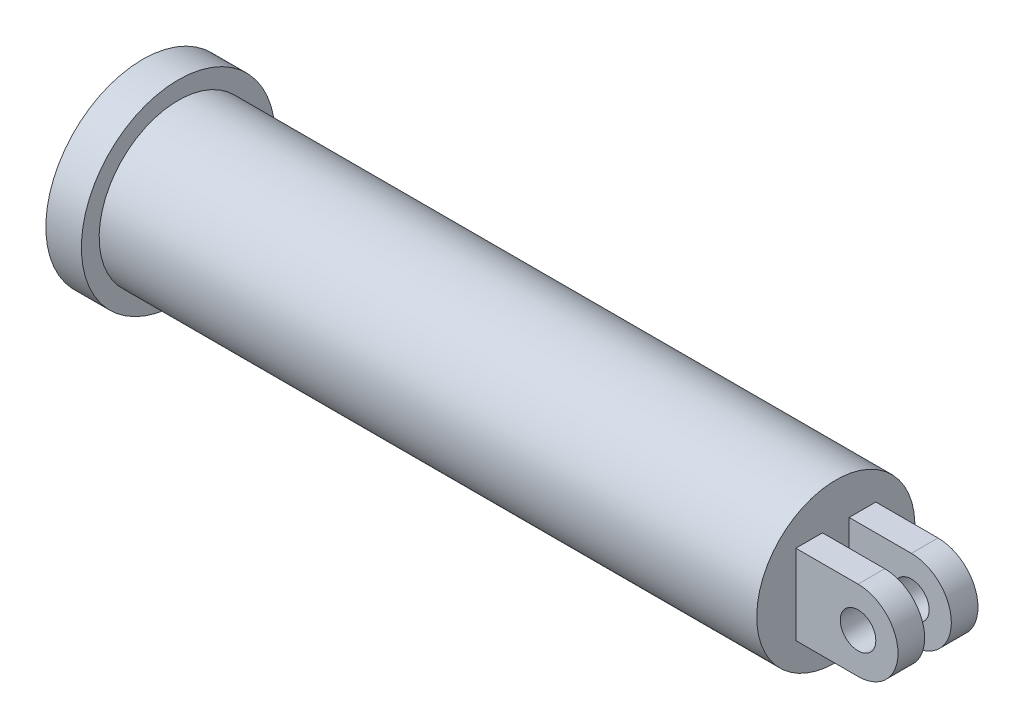
ISO-10303-21;
HEADER;
FILE_DESCRIPTION(('STEP AP214'),'2;1');
FILE_NAME('part.step','',(''),(''),'','','');
FILE_SCHEMA(('AUTOMOTIVE_DESIGN { 1 0 10303 214 1 1 1 1 }'));
ENDSEC;
DATA;
#1=APPLICATION_CONTEXT('core data for automotive mechanical design processes');
#2=APPLICATION_PROTOCOL_DEFINITION('international standard','automotive_design',2000,#1);
#3=PRODUCT_CONTEXT('',#1,'mechanical');
#4=PRODUCT('Part','Part','',(#3));
#5=PRODUCT_RELATED_PRODUCT_CATEGORY('part','',(#4));
#6=PRODUCT_DEFINITION_FORMATION('','',#4);
#7=PRODUCT_DEFINITION_CONTEXT('part definition',#1,'design');
#8=PRODUCT_DEFINITION('design','',#6,#7);
#9=PRODUCT_DEFINITION_SHAPE('','',#8);
#10=(LENGTH_UNIT() NAMED_UNIT(*) SI_UNIT(.MILLI.,.METRE.));
#11=(NAMED_UNIT(*) PLANE_ANGLE_UNIT() SI_UNIT($,.RADIAN.));
#12=(NAMED_UNIT(*) SI_UNIT($,.STERADIAN.) SOLID_ANGLE_UNIT());
#13=UNCERTAINTY_MEASURE_WITH_UNIT(LENGTH_MEASURE(1.E-05),#10,'distance_accuracy_value','');
#14=(GEOMETRIC_REPRESENTATION_CONTEXT(3) GLOBAL_UNCERTAINTY_ASSIGNED_CONTEXT((#13)) GLOBAL_UNIT_ASSIGNED_CONTEXT((#10,
#11,#12)) REPRESENTATION_CONTEXT('',''));
#15=CARTESIAN_POINT('',(0.,0.,0.));
#16=DIRECTION('',(0.,0.,1.));
#17=DIRECTION('',(1.,0.,0.));
#18=AXIS2_PLACEMENT_3D('',#15,#16,#17);
#19=CARTESIAN_POINT('',(195.,0.,0.));
#20=DIRECTION('',(-1.,0.,0.));
#21=DIRECTION('',(0.,-1.,0.));
#22=AXIS2_PLACEMENT_3D('',#19,#20,#21);
#23=PLANE('',#22);
#24=DIRECTION('',(0.,0.,-1.));
#25=VECTOR('',#24,1.);
#26=CARTESIAN_POINT('',(195.,-22.5,22.5));
#27=LINE('',#26,#25);
#28=CARTESIAN_POINT('',(195.,-22.5,22.5));
#29=VERTEX_POINT('',#28);
#30=CARTESIAN_POINT('',(195.,-22.5,7.5));
#31=VERTEX_POINT('',#30);
#32=EDGE_CURVE('E71',#29,#31,#27,.T.);
#33=ORIENTED_EDGE('',*,*,#32,.F.);
#34=DIRECTION('',(0.,-1.,0.));
#35=VECTOR('',#34,1.);
#36=CARTESIAN_POINT('',(195.,22.5,22.5));
#37=LINE('',#36,#35);
#38=CARTESIAN_POINT('',(195.,22.5,22.5));
#39=VERTEX_POINT('',#38);
#40=EDGE_CURVE('E148',#39,#29,#37,.T.);
#41=ORIENTED_EDGE('',*,*,#40,.F.);
#42=DIRECTION('',(0.,0.,-1.));
#43=VECTOR('',#42,1.);
#44=CARTESIAN_POINT('',(195.,22.5,22.5));
#45=LINE('',#44,#43);
#46=CARTESIAN_POINT('',(195.,22.5,7.5));
#47=VERTEX_POINT('',#46);
#48=EDGE_CURVE('E159',#39,#47,#45,.T.);
#49=ORIENTED_EDGE('',*,*,#48,.T.);
#50=DIRECTION('',(0.,-1.,0.));
#51=VECTOR('',#50,1.);
#52=CARTESIAN_POINT('',(195.,22.5,7.5));
#53=LINE('',#52,#51);
#54=EDGE_CURVE('E146',#47,#31,#53,.T.);
#55=ORIENTED_EDGE('',*,*,#54,.T.);
#56=EDGE_LOOP('',(#33,#41,#49,#55));
#57=FACE_BOUND('',#56,.T.);
#58=CARTESIAN_POINT('',(195.,0.,0.));
#59=DIRECTION('',(-1.,0.,0.));
#60=DIRECTION('',(0.,-1.,0.));
#61=AXIS2_PLACEMENT_3D('',#58,#59,#60);
#62=CIRCLE('',#61,44.4999999999999);
#63=CARTESIAN_POINT('',(195.,-44.4999999999999,0.));
#64=VERTEX_POINT('',#63);
#65=EDGE_CURVE('E13',#64,#64,#62,.T.);
#66=ORIENTED_EDGE('',*,*,#65,.F.);
#67=EDGE_LOOP('',(#66));
#68=FACE_BOUND('',#67,.T.);
#69=DIRECTION('',(0.,-1.,0.));
#70=VECTOR('',#69,1.);
#71=CARTESIAN_POINT('',(195.,22.5,-22.5));
#72=LINE('',#71,#70);
#73=CARTESIAN_POINT('',(195.,22.5,-22.5));
#74=VERTEX_POINT('',#73);
#75=CARTESIAN_POINT('',(195.,-22.5,-22.5));
#76=VERTEX_POINT('',#75);
#77=EDGE_CURVE('E115',#74,#76,#72,.T.);
#78=ORIENTED_EDGE('',*,*,#77,.T.);
#79=DIRECTION('',(0.,0.,1.));
#80=VECTOR('',#79,1.);
#81=CARTESIAN_POINT('',(195.,-22.5,-22.5));
#82=LINE('',#81,#80);
#83=CARTESIAN_POINT('',(195.,-22.5,-7.5));
#84=VERTEX_POINT('',#83);
#85=EDGE_CURVE('E262',#76,#84,#82,.T.);
#86=ORIENTED_EDGE('',*,*,#85,.T.);
#87=DIRECTION('',(0.,-1.,0.));
#88=VECTOR('',#87,1.);
#89=CARTESIAN_POINT('',(195.,22.5,-7.5));
#90=LINE('',#89,#88);
#91=CARTESIAN_POINT('',(195.,22.5,-7.5));
#92=VERTEX_POINT('',#91);
#93=EDGE_CURVE('E135',#92,#84,#90,.T.);
#94=ORIENTED_EDGE('',*,*,#93,.F.);
#95=DIRECTION('',(0.,0.,1.));
#96=VECTOR('',#95,1.);
#97=CARTESIAN_POINT('',(195.,22.5,-22.5));
#98=LINE('',#97,#96);
#99=EDGE_CURVE('E130',#74,#92,#98,.T.);
#100=ORIENTED_EDGE('',*,*,#99,.F.);
#101=EDGE_LOOP('',(#78,#86,#94,#100));
#102=FACE_BOUND('',#101,.T.);
#103=ADVANCED_FACE('F48',(#57,#68,#102),#23,.F.);
#104=CARTESIAN_POINT('',(-195.,54.5,0.));
#105=DIRECTION('',(1.,0.,0.));
#106=DIRECTION('',(0.,1.,0.));
#107=AXIS2_PLACEMENT_3D('',#104,#105,#106);
#108=PLANE('',#107);
#109=CARTESIAN_POINT('',(-195.,0.,0.));
#110=DIRECTION('',(-1.,0.,0.));
#111=DIRECTION('',(0.,-1.,0.));
#112=AXIS2_PLACEMENT_3D('',#109,#110,#111);
#113=CIRCLE('',#112,54.5);
#114=CARTESIAN_POINT('',(-195.,-54.5,0.));
#115=VERTEX_POINT('',#114);
#116=EDGE_CURVE('E175',#115,#115,#113,.T.);
#117=ORIENTED_EDGE('',*,*,#116,.T.);
#118=EDGE_LOOP('',(#117));
#119=FACE_BOUND('',#118,.T.);
#120=ADVANCED_FACE('F50',(#119),#108,.F.);
#121=CARTESIAN_POINT('',(-195.,0.,0.));
#122=DIRECTION('',(-1.,0.,0.));
#123=DIRECTION('',(0.,-1.,0.));
#124=AXIS2_PLACEMENT_3D('',#121,#122,#123);
#125=CYLINDRICAL_SURFACE('',#124,44.4999999999999);
#126=CARTESIAN_POINT('',(-175.,0.,0.));
#127=DIRECTION('',(-1.,0.,0.));
#128=DIRECTION('',(0.,-1.,0.));
#129=AXIS2_PLACEMENT_3D('',#126,#127,#128);
#130=CIRCLE('',#129,44.5);
#131=CARTESIAN_POINT('',(-175.,-44.4999999999999,0.));
#132=VERTEX_POINT('',#131);
#133=EDGE_CURVE('E56',#132,#132,#130,.T.);
#134=ORIENTED_EDGE('',*,*,#133,.F.);
#135=EDGE_LOOP('',(#134));
#136=FACE_BOUND('',#135,.T.);
#137=ORIENTED_EDGE('',*,*,#65,.T.);
#138=EDGE_LOOP('',(#137));
#139=FACE_BOUND('',#138,.T.);
#140=ADVANCED_FACE('F185',(#136,#139),#125,.T.);
#141=CARTESIAN_POINT('',(-175.,44.5,0.));
#142=DIRECTION('',(-1.,0.,0.));
#143=DIRECTION('',(0.,-1.,0.));
#144=AXIS2_PLACEMENT_3D('',#141,#142,#143);
#145=PLANE('',#144);
#146=CARTESIAN_POINT('',(-175.,0.,0.));
#147=DIRECTION('',(-1.,0.,0.));
#148=DIRECTION('',(0.,-1.,0.));
#149=AXIS2_PLACEMENT_3D('',#146,#147,#148);
#150=CIRCLE('',#149,54.5);
#151=CARTESIAN_POINT('',(-175.,-54.5,0.));
#152=VERTEX_POINT('',#151);
#153=EDGE_CURVE('E178',#152,#152,#150,.T.);
#154=ORIENTED_EDGE('',*,*,#153,.F.);
#155=EDGE_LOOP('',(#154));
#156=FACE_BOUND('',#155,.T.);
#157=ORIENTED_EDGE('',*,*,#133,.T.);
#158=EDGE_LOOP('',(#157));
#159=FACE_BOUND('',#158,.T.);
#160=ADVANCED_FACE('F183',(#156,#159),#145,.F.);
#161=CARTESIAN_POINT('',(-195.,0.,0.));
#162=DIRECTION('',(-1.,0.,0.));
#163=DIRECTION('',(0.,-1.,0.));
#164=AXIS2_PLACEMENT_3D('',#161,#162,#163);
#165=CYLINDRICAL_SURFACE('',#164,54.5);
#166=ORIENTED_EDGE('',*,*,#116,.F.);
#167=EDGE_LOOP('',(#166));
#168=FACE_BOUND('',#167,.T.);
#169=ORIENTED_EDGE('',*,*,#153,.T.);
#170=EDGE_LOOP('',(#169));
#171=FACE_BOUND('',#170,.T.);
#172=ADVANCED_FACE('F199',(#168,#171),#165,.T.);
#173=CARTESIAN_POINT('',(230.,0.,22.5));
#174=DIRECTION('',(0.,0.,-1.));
#175=DIRECTION('',(-1.,0.,0.));
#176=AXIS2_PLACEMENT_3D('',#173,#174,#175);
#177=PLANE('',#176);
#178=ORIENTED_EDGE('',*,*,#40,.T.);
#179=DIRECTION('',(1.,0.,0.));
#180=VECTOR('',#179,1.);
#181=CARTESIAN_POINT('',(195.,-22.5,22.5));
#182=LINE('',#181,#180);
#183=CARTESIAN_POINT('',(230.,-22.5,22.5));
#184=VERTEX_POINT('',#183);
#185=EDGE_CURVE('E151',#29,#184,#182,.T.);
#186=ORIENTED_EDGE('',*,*,#185,.T.);
#187=CARTESIAN_POINT('',(230.,0.,22.5));
#188=DIRECTION('',(0.,0.,1.));
#189=DIRECTION('',(-1.,0.,0.));
#190=AXIS2_PLACEMENT_3D('',#187,#188,#189);
#191=CIRCLE('',#190,22.5);
#192=CARTESIAN_POINT('',(230.,22.5,22.5));
#193=VERTEX_POINT('',#192);
#194=EDGE_CURVE('E154',#184,#193,#191,.T.);
#195=ORIENTED_EDGE('',*,*,#194,.T.);
#196=DIRECTION('',(-1.,0.,0.));
#197=VECTOR('',#196,1.);
#198=CARTESIAN_POINT('',(195.,22.5,22.5));
#199=LINE('',#198,#197);
#200=EDGE_CURVE('E156',#193,#39,#199,.T.);
#201=ORIENTED_EDGE('',*,*,#200,.T.);
#202=EDGE_LOOP('',(#178,#186,#195,#201));
#203=FACE_BOUND('',#202,.T.);
#204=CARTESIAN_POINT('',(230.,0.,22.5));
#205=DIRECTION('',(0.,0.,1.));
#206=DIRECTION('',(1.,0.,0.));
#207=AXIS2_PLACEMENT_3D('',#204,#205,#206);
#208=CIRCLE('',#207,10.);
#209=CARTESIAN_POINT('',(240.,0.,22.5));
#210=VERTEX_POINT('',#209);
#211=EDGE_CURVE('E139',#210,#210,#208,.T.);
#212=ORIENTED_EDGE('',*,*,#211,.F.);
#213=EDGE_LOOP('',(#212));
#214=FACE_BOUND('',#213,.T.);
#215=ADVANCED_FACE('F203',(#203,#214),#177,.F.);
#216=CARTESIAN_POINT('',(230.,0.,7.5));
#217=DIRECTION('',(0.,0.,-1.));
#218=DIRECTION('',(-1.,0.,0.));
#219=AXIS2_PLACEMENT_3D('',#216,#217,#218);
#220=PLANE('',#219);
#221=ORIENTED_EDGE('',*,*,#54,.F.);
#222=DIRECTION('',(-1.,0.,0.));
#223=VECTOR('',#222,1.);
#224=CARTESIAN_POINT('',(195.,22.5,7.5));
#225=LINE('',#224,#223);
#226=CARTESIAN_POINT('',(230.,22.5,7.5));
#227=VERTEX_POINT('',#226);
#228=EDGE_CURVE('E152',#227,#47,#225,.T.);
#229=ORIENTED_EDGE('',*,*,#228,.F.);
#230=CARTESIAN_POINT('',(230.,0.,7.5));
#231=DIRECTION('',(0.,0.,1.));
#232=DIRECTION('',(-1.,0.,0.));
#233=AXIS2_PLACEMENT_3D('',#230,#231,#232);
#234=CIRCLE('',#233,22.5);
#235=CARTESIAN_POINT('',(230.,-22.5,7.5));
#236=VERTEX_POINT('',#235);
#237=EDGE_CURVE('E163',#236,#227,#234,.T.);
#238=ORIENTED_EDGE('',*,*,#237,.F.);
#239=DIRECTION('',(1.,0.,0.));
#240=VECTOR('',#239,1.);
#241=CARTESIAN_POINT('',(195.,-22.5,7.5));
#242=LINE('',#241,#240);
#243=EDGE_CURVE('E161',#31,#236,#242,.T.);
#244=ORIENTED_EDGE('',*,*,#243,.F.);
#245=EDGE_LOOP('',(#221,#229,#238,#244));
#246=FACE_BOUND('',#245,.T.);
#247=CARTESIAN_POINT('',(230.,0.,7.5));
#248=DIRECTION('',(0.,0.,1.));
#249=DIRECTION('',(1.,0.,0.));
#250=AXIS2_PLACEMENT_3D('',#247,#248,#249);
#251=CIRCLE('',#250,10.);
#252=CARTESIAN_POINT('',(240.,0.,7.5));
#253=VERTEX_POINT('',#252);
#254=EDGE_CURVE('E136',#253,#253,#251,.T.);
#255=ORIENTED_EDGE('',*,*,#254,.T.);
#256=EDGE_LOOP('',(#255));
#257=FACE_BOUND('',#256,.T.);
#258=ADVANCED_FACE('F209',(#246,#257),#220,.T.);
#259=CARTESIAN_POINT('',(195.,-22.5,22.5));
#260=DIRECTION('',(0.,1.,0.));
#261=DIRECTION('',(-1.,0.,0.));
#262=AXIS2_PLACEMENT_3D('',#259,#260,#261);
#263=PLANE('',#262);
#264=ORIENTED_EDGE('',*,*,#243,.T.);
#265=DIRECTION('',(0.,0.,-1.));
#266=VECTOR('',#265,1.);
#267=CARTESIAN_POINT('',(230.,-22.5,22.5));
#268=LINE('',#267,#266);
#269=EDGE_CURVE('E171',#184,#236,#268,.T.);
#270=ORIENTED_EDGE('',*,*,#269,.F.);
#271=ORIENTED_EDGE('',*,*,#185,.F.);
#272=ORIENTED_EDGE('',*,*,#32,.T.);
#273=EDGE_LOOP('',(#264,#270,#271,#272));
#274=FACE_BOUND('',#273,.T.);
#275=ADVANCED_FACE('F205',(#274),#263,.F.);
#276=CARTESIAN_POINT('',(230.,0.,22.5));
#277=DIRECTION('',(0.,0.,-1.));
#278=DIRECTION('',(-1.,0.,0.));
#279=AXIS2_PLACEMENT_3D('',#276,#277,#278);
#280=CYLINDRICAL_SURFACE('',#279,22.5);
#281=ORIENTED_EDGE('',*,*,#237,.T.);
#282=DIRECTION('',(0.,0.,-1.));
#283=VECTOR('',#282,1.);
#284=CARTESIAN_POINT('',(230.,22.5,22.5));
#285=LINE('',#284,#283);
#286=EDGE_CURVE('E168',#193,#227,#285,.T.);
#287=ORIENTED_EDGE('',*,*,#286,.F.);
#288=ORIENTED_EDGE('',*,*,#194,.F.);
#289=ORIENTED_EDGE('',*,*,#269,.T.);
#290=EDGE_LOOP('',(#281,#287,#288,#289));
#291=FACE_BOUND('',#290,.T.);
#292=ADVANCED_FACE('F208',(#291),#280,.T.);
#293=CARTESIAN_POINT('',(195.,22.5,22.5));
#294=DIRECTION('',(0.,-1.,0.));
#295=DIRECTION('',(1.,0.,0.));
#296=AXIS2_PLACEMENT_3D('',#293,#294,#295);
#297=PLANE('',#296);
#298=ORIENTED_EDGE('',*,*,#228,.T.);
#299=ORIENTED_EDGE('',*,*,#48,.F.);
#300=ORIENTED_EDGE('',*,*,#200,.F.);
#301=ORIENTED_EDGE('',*,*,#286,.T.);
#302=EDGE_LOOP('',(#298,#299,#300,#301));
#303=FACE_BOUND('',#302,.T.);
#304=ADVANCED_FACE('F213',(#303),#297,.F.);
#305=CARTESIAN_POINT('',(230.,0.,22.5));
#306=DIRECTION('',(0.,0.,-1.));
#307=DIRECTION('',(-1.,0.,0.));
#308=AXIS2_PLACEMENT_3D('',#305,#306,#307);
#309=CYLINDRICAL_SURFACE('',#308,10.);
#310=ORIENTED_EDGE('',*,*,#211,.T.);
#311=EDGE_LOOP('',(#310));
#312=FACE_BOUND('',#311,.T.);
#313=ORIENTED_EDGE('',*,*,#254,.F.);
#314=EDGE_LOOP('',(#313));
#315=FACE_BOUND('',#314,.T.);
#316=ADVANCED_FACE('F217',(#312,#315),#309,.F.);
#317=CARTESIAN_POINT('',(195.,22.5,-22.5));
#318=DIRECTION('',(0.,1.,0.));
#319=DIRECTION('',(-1.,0.,0.));
#320=AXIS2_PLACEMENT_3D('',#317,#318,#319);
#321=PLANE('',#320);
#322=DIRECTION('',(-1.,0.,0.));
#323=VECTOR('',#322,1.);
#324=CARTESIAN_POINT('',(195.,22.5,-7.5));
#325=LINE('',#324,#323);
#326=CARTESIAN_POINT('',(230.,22.5,-7.5));
#327=VERTEX_POINT('',#326);
#328=EDGE_CURVE('E63',#327,#92,#325,.T.);
#329=ORIENTED_EDGE('',*,*,#328,.F.);
#330=DIRECTION('',(0.,0.,1.));
#331=VECTOR('',#330,1.);
#332=CARTESIAN_POINT('',(230.,22.5,-22.5));
#333=LINE('',#332,#331);
#334=CARTESIAN_POINT('',(230.,22.5,-22.5));
#335=VERTEX_POINT('',#334);
#336=EDGE_CURVE('E132',#335,#327,#333,.T.);
#337=ORIENTED_EDGE('',*,*,#336,.F.);
#338=DIRECTION('',(-1.,0.,0.));
#339=VECTOR('',#338,1.);
#340=CARTESIAN_POINT('',(195.,22.5,-22.5));
#341=LINE('',#340,#339);
#342=EDGE_CURVE('E119',#335,#74,#341,.T.);
#343=ORIENTED_EDGE('',*,*,#342,.T.);
#344=ORIENTED_EDGE('',*,*,#99,.T.);
#345=EDGE_LOOP('',(#329,#337,#343,#344));
#346=FACE_BOUND('',#345,.T.);
#347=ADVANCED_FACE('F129',(#346),#321,.T.);
#348=CARTESIAN_POINT('',(230.,0.,-22.5));
#349=DIRECTION('',(0.,0.,1.));
#350=DIRECTION('',(1.,0.,0.));
#351=AXIS2_PLACEMENT_3D('',#348,#349,#350);
#352=CYLINDRICAL_SURFACE('',#351,22.5);
#353=CARTESIAN_POINT('',(230.,0.,-7.5));
#354=DIRECTION('',(0.,0.,1.));
#355=DIRECTION('',(-1.,0.,0.));
#356=AXIS2_PLACEMENT_3D('',#353,#354,#355);
#357=CIRCLE('',#356,22.5);
#358=CARTESIAN_POINT('',(230.,-22.5,-7.5));
#359=VERTEX_POINT('',#358);
#360=EDGE_CURVE('E265',#359,#327,#357,.T.);
#361=ORIENTED_EDGE('',*,*,#360,.F.);
#362=DIRECTION('',(0.,0.,1.));
#363=VECTOR('',#362,1.);
#364=CARTESIAN_POINT('',(230.,-22.5,-22.5));
#365=LINE('',#364,#363);
#366=CARTESIAN_POINT('',(230.,-22.5,-22.5));
#367=VERTEX_POINT('',#366);
#368=EDGE_CURVE('E141',#367,#359,#365,.T.);
#369=ORIENTED_EDGE('',*,*,#368,.F.);
#370=CARTESIAN_POINT('',(230.,0.,-22.5));
#371=DIRECTION('',(0.,0.,1.));
#372=DIRECTION('',(-1.,0.,0.));
#373=AXIS2_PLACEMENT_3D('',#370,#371,#372);
#374=CIRCLE('',#373,22.5);
#375=EDGE_CURVE('E133',#367,#335,#374,.T.);
#376=ORIENTED_EDGE('',*,*,#375,.T.);
#377=ORIENTED_EDGE('',*,*,#336,.T.);
#378=EDGE_LOOP('',(#361,#369,#376,#377));
#379=FACE_BOUND('',#378,.T.);
#380=ADVANCED_FACE('F230',(#379),#352,.T.);
#381=CARTESIAN_POINT('',(195.,-22.5,-22.5));
#382=DIRECTION('',(0.,-1.,0.));
#383=DIRECTION('',(1.,0.,0.));
#384=AXIS2_PLACEMENT_3D('',#381,#382,#383);
#385=PLANE('',#384);
#386=DIRECTION('',(1.,0.,0.));
#387=VECTOR('',#386,1.);
#388=CARTESIAN_POINT('',(195.,-22.5,-7.5));
#389=LINE('',#388,#387);
#390=EDGE_CURVE('E126',#84,#359,#389,.T.);
#391=ORIENTED_EDGE('',*,*,#390,.F.);
#392=ORIENTED_EDGE('',*,*,#85,.F.);
#393=DIRECTION('',(1.,0.,0.));
#394=VECTOR('',#393,1.);
#395=CARTESIAN_POINT('',(195.,-22.5,-22.5));
#396=LINE('',#395,#394);
#397=EDGE_CURVE('E122',#76,#367,#396,.T.);
#398=ORIENTED_EDGE('',*,*,#397,.T.);
#399=ORIENTED_EDGE('',*,*,#368,.T.);
#400=EDGE_LOOP('',(#391,#392,#398,#399));
#401=FACE_BOUND('',#400,.T.);
#402=ADVANCED_FACE('F233',(#401),#385,.T.);
#403=CARTESIAN_POINT('',(230.,0.,-22.5));
#404=DIRECTION('',(0.,0.,1.));
#405=DIRECTION('',(-1.,0.,0.));
#406=AXIS2_PLACEMENT_3D('',#403,#404,#405);
#407=PLANE('',#406);
#408=CARTESIAN_POINT('',(230.,0.,-22.5));
#409=DIRECTION('',(0.,0.,1.));
#410=DIRECTION('',(1.,0.,0.));
#411=AXIS2_PLACEMENT_3D('',#408,#409,#410);
#412=CIRCLE('',#411,10.);
#413=CARTESIAN_POINT('',(240.,0.,-22.5));
#414=VERTEX_POINT('',#413);
#415=EDGE_CURVE('E253',#414,#414,#412,.T.);
#416=ORIENTED_EDGE('',*,*,#415,.T.);
#417=EDGE_LOOP('',(#416));
#418=FACE_BOUND('',#417,.T.);
#419=ORIENTED_EDGE('',*,*,#77,.F.);
#420=ORIENTED_EDGE('',*,*,#342,.F.);
#421=ORIENTED_EDGE('',*,*,#375,.F.);
#422=ORIENTED_EDGE('',*,*,#397,.F.);
#423=EDGE_LOOP('',(#419,#420,#421,#422));
#424=FACE_BOUND('',#423,.T.);
#425=ADVANCED_FACE('F117',(#418,#424),#407,.F.);
#426=CARTESIAN_POINT('',(230.,0.,-7.5));
#427=DIRECTION('',(0.,0.,1.));
#428=DIRECTION('',(-1.,0.,0.));
#429=AXIS2_PLACEMENT_3D('',#426,#427,#428);
#430=PLANE('',#429);
#431=CARTESIAN_POINT('',(230.,0.,-7.5));
#432=DIRECTION('',(0.,0.,1.));
#433=DIRECTION('',(1.,0.,0.));
#434=AXIS2_PLACEMENT_3D('',#431,#432,#433);
#435=CIRCLE('',#434,10.);
#436=CARTESIAN_POINT('',(240.,0.,-7.5));
#437=VERTEX_POINT('',#436);
#438=EDGE_CURVE('E256',#437,#437,#435,.T.);
#439=ORIENTED_EDGE('',*,*,#438,.F.);
#440=EDGE_LOOP('',(#439));
#441=FACE_BOUND('',#440,.T.);
#442=ORIENTED_EDGE('',*,*,#93,.T.);
#443=ORIENTED_EDGE('',*,*,#390,.T.);
#444=ORIENTED_EDGE('',*,*,#360,.T.);
#445=ORIENTED_EDGE('',*,*,#328,.T.);
#446=EDGE_LOOP('',(#442,#443,#444,#445));
#447=FACE_BOUND('',#446,.T.);
#448=ADVANCED_FACE('F238',(#441,#447),#430,.T.);
#449=CARTESIAN_POINT('',(230.,0.,-22.5));
#450=DIRECTION('',(0.,0.,1.));
#451=DIRECTION('',(1.,0.,0.));
#452=AXIS2_PLACEMENT_3D('',#449,#450,#451);
#453=CYLINDRICAL_SURFACE('',#452,10.);
#454=ORIENTED_EDGE('',*,*,#415,.F.);
#455=EDGE_LOOP('',(#454));
#456=FACE_BOUND('',#455,.T.);
#457=ORIENTED_EDGE('',*,*,#438,.T.);
#458=EDGE_LOOP('',(#457));
#459=FACE_BOUND('',#458,.T.);
#460=ADVANCED_FACE('F241',(#456,#459),#453,.F.);
#461=CLOSED_SHELL('',(#103,#120,#140,#160,#172,#215,#258,#275,#292,#304,#316,#347,#380,#402,
#425,#448,#460));
#462=MANIFOLD_SOLID_BREP('B2',#461);
#463=ADVANCED_BREP_SHAPE_REPRESENTATION('',(#18,#462),#14);
#464=SHAPE_DEFINITION_REPRESENTATION(#9,#463);
ENDSEC;
END-ISO-10303-21;
